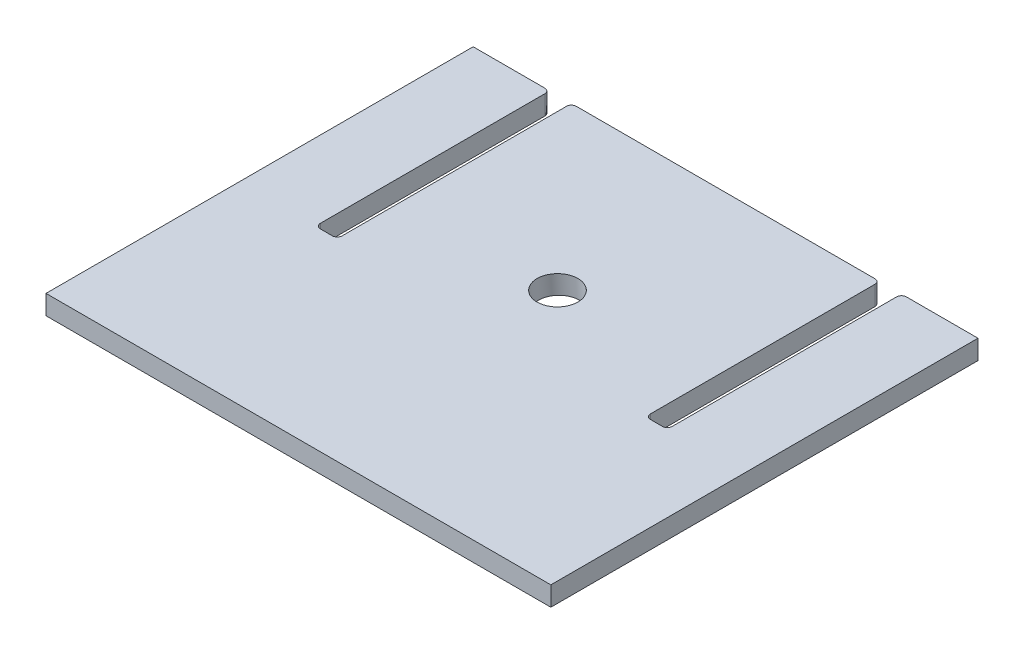
ISO-10303-21;
HEADER;
FILE_DESCRIPTION(('STEP AP214'),'2;1');
FILE_NAME('part.step','',(''),(''),'','','');
FILE_SCHEMA(('AUTOMOTIVE_DESIGN { 1 0 10303 214 1 1 1 1 }'));
ENDSEC;
DATA;
#1=APPLICATION_CONTEXT('core data for automotive mechanical design processes');
#2=APPLICATION_PROTOCOL_DEFINITION('international standard','automotive_design',2000,#1);
#3=PRODUCT_CONTEXT('',#1,'mechanical');
#4=PRODUCT('Part','Part','',(#3));
#5=PRODUCT_RELATED_PRODUCT_CATEGORY('part','',(#4));
#6=PRODUCT_DEFINITION_FORMATION('','',#4);
#7=PRODUCT_DEFINITION_CONTEXT('part definition',#1,'design');
#8=PRODUCT_DEFINITION('design','',#6,#7);
#9=PRODUCT_DEFINITION_SHAPE('','',#8);
#10=(LENGTH_UNIT() NAMED_UNIT(*) SI_UNIT(.MILLI.,.METRE.));
#11=(NAMED_UNIT(*) PLANE_ANGLE_UNIT() SI_UNIT($,.RADIAN.));
#12=(NAMED_UNIT(*) SI_UNIT($,.STERADIAN.) SOLID_ANGLE_UNIT());
#13=UNCERTAINTY_MEASURE_WITH_UNIT(LENGTH_MEASURE(1.E-05),#10,'distance_accuracy_value','');
#14=(GEOMETRIC_REPRESENTATION_CONTEXT(3) GLOBAL_UNCERTAINTY_ASSIGNED_CONTEXT((#13)) GLOBAL_UNIT_ASSIGNED_CONTEXT((#10,
#11,#12)) REPRESENTATION_CONTEXT('',''));
#15=CARTESIAN_POINT('',(0.,0.,0.));
#16=DIRECTION('',(0.,0.,1.));
#17=DIRECTION('',(1.,0.,0.));
#18=AXIS2_PLACEMENT_3D('',#15,#16,#17);
#19=CARTESIAN_POINT('',(-165.1,6.35,-139.7));
#20=DIRECTION('',(0.,0.,1.));
#21=DIRECTION('',(1.,0.,0.));
#22=AXIS2_PLACEMENT_3D('',#19,#20,#21);
#23=PLANE('',#22);
#24=DIRECTION('',(-1.,0.,0.));
#25=VECTOR('',#24,1.);
#26=CARTESIAN_POINT('',(-165.1,6.35,-139.7));
#27=LINE('',#26,#25);
#28=CARTESIAN_POINT('',(-118.237,6.35,-139.7));
#29=VERTEX_POINT('',#28);
#30=CARTESIAN_POINT('',(-165.1,6.35,-139.7));
#31=VERTEX_POINT('',#30);
#32=EDGE_CURVE('E227',#29,#31,#27,.T.);
#33=ORIENTED_EDGE('',*,*,#32,.F.);
#34=DIRECTION('',(0.,1.,0.));
#35=VECTOR('',#34,1.);
#36=CARTESIAN_POINT('',(-118.237,6.35,-139.7));
#37=LINE('',#36,#35);
#38=CARTESIAN_POINT('',(-118.237,-6.35,-139.7));
#39=VERTEX_POINT('',#38);
#40=EDGE_CURVE('E62',#29,#39,#37,.F.);
#41=ORIENTED_EDGE('',*,*,#40,.T.);
#42=DIRECTION('',(-1.,0.,0.));
#43=VECTOR('',#42,1.);
#44=CARTESIAN_POINT('',(-165.1,-6.35,-139.7));
#45=LINE('',#44,#43);
#46=CARTESIAN_POINT('',(-165.1,-6.35,-139.7));
#47=VERTEX_POINT('',#46);
#48=EDGE_CURVE('E416',#39,#47,#45,.T.);
#49=ORIENTED_EDGE('',*,*,#48,.T.);
#50=DIRECTION('',(0.,-1.,0.));
#51=VECTOR('',#50,1.);
#52=CARTESIAN_POINT('',(-165.1,6.35,-139.7));
#53=LINE('',#52,#51);
#54=EDGE_CURVE('E197',#31,#47,#53,.T.);
#55=ORIENTED_EDGE('',*,*,#54,.F.);
#56=EDGE_LOOP('',(#33,#41,#49,#55));
#57=FACE_BOUND('',#56,.T.);
#58=ADVANCED_FACE('F46',(#57),#23,.F.);
#59=CARTESIAN_POINT('',(165.1,-6.35,-139.7));
#60=VERTEX_POINT('',#59);
#61=CARTESIAN_POINT('',(118.237,-6.35,-139.7));
#62=VERTEX_POINT('',#61);
#63=EDGE_CURVE('E211',#60,#62,#45,.T.);
#64=ORIENTED_EDGE('',*,*,#63,.T.);
#65=DIRECTION('',(0.,1.,0.));
#66=VECTOR('',#65,1.);
#67=CARTESIAN_POINT('',(118.237,6.35,-139.7));
#68=LINE('',#67,#66);
#69=CARTESIAN_POINT('',(118.237,6.35,-139.7));
#70=VERTEX_POINT('',#69);
#71=EDGE_CURVE('E327',#62,#70,#68,.T.);
#72=ORIENTED_EDGE('',*,*,#71,.T.);
#73=CARTESIAN_POINT('',(165.1,6.35,-139.7));
#74=VERTEX_POINT('',#73);
#75=EDGE_CURVE('E228',#74,#70,#27,.T.);
#76=ORIENTED_EDGE('',*,*,#75,.F.);
#77=DIRECTION('',(0.,-1.,0.));
#78=VECTOR('',#77,1.);
#79=CARTESIAN_POINT('',(165.1,6.35,-139.7));
#80=LINE('',#79,#78);
#81=EDGE_CURVE('E214',#74,#60,#80,.T.);
#82=ORIENTED_EDGE('',*,*,#81,.T.);
#83=EDGE_LOOP('',(#64,#72,#76,#82));
#84=FACE_BOUND('',#83,.T.);
#85=ADVANCED_FACE('F461',(#84),#23,.F.);
#86=CARTESIAN_POINT('',(165.1,6.35,139.7));
#87=DIRECTION('',(-1.,0.,0.));
#88=DIRECTION('',(0.,0.,1.));
#89=AXIS2_PLACEMENT_3D('',#86,#87,#88);
#90=PLANE('',#89);
#91=DIRECTION('',(0.,0.,-1.));
#92=VECTOR('',#91,1.);
#93=CARTESIAN_POINT('',(165.1,-6.35,139.7));
#94=LINE('',#93,#92);
#95=CARTESIAN_POINT('',(165.1,-6.35,139.7));
#96=VERTEX_POINT('',#95);
#97=EDGE_CURVE('E203',#96,#60,#94,.T.);
#98=ORIENTED_EDGE('',*,*,#97,.T.);
#99=ORIENTED_EDGE('',*,*,#81,.F.);
#100=DIRECTION('',(0.,0.,-1.));
#101=VECTOR('',#100,1.);
#102=CARTESIAN_POINT('',(165.1,6.35,139.7));
#103=LINE('',#102,#101);
#104=CARTESIAN_POINT('',(165.1,6.35,139.7));
#105=VERTEX_POINT('',#104);
#106=EDGE_CURVE('E205',#105,#74,#103,.T.);
#107=ORIENTED_EDGE('',*,*,#106,.F.);
#108=DIRECTION('',(0.,-1.,0.));
#109=VECTOR('',#108,1.);
#110=CARTESIAN_POINT('',(165.1,6.35,139.7));
#111=LINE('',#110,#109);
#112=EDGE_CURVE('E190',#105,#96,#111,.T.);
#113=ORIENTED_EDGE('',*,*,#112,.T.);
#114=EDGE_LOOP('',(#98,#99,#107,#113));
#115=FACE_BOUND('',#114,.T.);
#116=ADVANCED_FACE('F201',(#115),#90,.F.);
#117=CARTESIAN_POINT('',(97.663,6.35,-139.7));
#118=VERTEX_POINT('',#117);
#119=CARTESIAN_POINT('',(-97.663,6.35,-139.7));
#120=VERTEX_POINT('',#119);
#121=EDGE_CURVE('E232',#118,#120,#27,.T.);
#122=ORIENTED_EDGE('',*,*,#121,.F.);
#123=DIRECTION('',(0.,1.,0.));
#124=VECTOR('',#123,1.);
#125=CARTESIAN_POINT('',(97.663,6.35,-139.7));
#126=LINE('',#125,#124);
#127=CARTESIAN_POINT('',(97.663,-6.35,-139.7));
#128=VERTEX_POINT('',#127);
#129=EDGE_CURVE('E313',#118,#128,#126,.F.);
#130=ORIENTED_EDGE('',*,*,#129,.T.);
#131=CARTESIAN_POINT('',(-97.663,-6.35,-139.7));
#132=VERTEX_POINT('',#131);
#133=EDGE_CURVE('E207',#128,#132,#45,.T.);
#134=ORIENTED_EDGE('',*,*,#133,.T.);
#135=DIRECTION('',(0.,1.,0.));
#136=VECTOR('',#135,1.);
#137=CARTESIAN_POINT('',(-97.663,6.35,-139.7));
#138=LINE('',#137,#136);
#139=EDGE_CURVE('E309',#132,#120,#138,.T.);
#140=ORIENTED_EDGE('',*,*,#139,.T.);
#141=EDGE_LOOP('',(#122,#130,#134,#140));
#142=FACE_BOUND('',#141,.T.);
#143=ADVANCED_FACE('F411',(#142),#23,.F.);
#144=CARTESIAN_POINT('',(-165.1,6.35,139.7));
#145=DIRECTION('',(1.,0.,0.));
#146=DIRECTION('',(0.,0.,-1.));
#147=AXIS2_PLACEMENT_3D('',#144,#145,#146);
#148=PLANE('',#147);
#149=DIRECTION('',(0.,0.,1.));
#150=VECTOR('',#149,1.);
#151=CARTESIAN_POINT('',(-165.1,-6.35,139.7));
#152=LINE('',#151,#150);
#153=CARTESIAN_POINT('',(-165.1,-6.35,139.7));
#154=VERTEX_POINT('',#153);
#155=EDGE_CURVE('E415',#47,#154,#152,.T.);
#156=ORIENTED_EDGE('',*,*,#155,.T.);
#157=DIRECTION('',(0.,-1.,0.));
#158=VECTOR('',#157,1.);
#159=CARTESIAN_POINT('',(-165.1,6.35,139.7));
#160=LINE('',#159,#158);
#161=CARTESIAN_POINT('',(-165.1,6.35,139.7));
#162=VERTEX_POINT('',#161);
#163=EDGE_CURVE('E193',#162,#154,#160,.T.);
#164=ORIENTED_EDGE('',*,*,#163,.F.);
#165=DIRECTION('',(0.,0.,1.));
#166=VECTOR('',#165,1.);
#167=CARTESIAN_POINT('',(-165.1,6.35,139.7));
#168=LINE('',#167,#166);
#169=EDGE_CURVE('E224',#31,#162,#168,.T.);
#170=ORIENTED_EDGE('',*,*,#169,.F.);
#171=ORIENTED_EDGE('',*,*,#54,.T.);
#172=EDGE_LOOP('',(#156,#164,#170,#171));
#173=FACE_BOUND('',#172,.T.);
#174=ADVANCED_FACE('F425',(#173),#148,.F.);
#175=CARTESIAN_POINT('',(-165.1,6.35,139.7));
#176=DIRECTION('',(0.,0.,-1.));
#177=DIRECTION('',(-1.,0.,0.));
#178=AXIS2_PLACEMENT_3D('',#175,#176,#177);
#179=PLANE('',#178);
#180=DIRECTION('',(1.,0.,0.));
#181=VECTOR('',#180,1.);
#182=CARTESIAN_POINT('',(-165.1,-6.35,139.7));
#183=LINE('',#182,#181);
#184=EDGE_CURVE('E186',#154,#96,#183,.T.);
#185=ORIENTED_EDGE('',*,*,#184,.T.);
#186=ORIENTED_EDGE('',*,*,#112,.F.);
#187=DIRECTION('',(1.,0.,0.));
#188=VECTOR('',#187,1.);
#189=CARTESIAN_POINT('',(-165.1,6.35,139.7));
#190=LINE('',#189,#188);
#191=EDGE_CURVE('E221',#162,#105,#190,.T.);
#192=ORIENTED_EDGE('',*,*,#191,.F.);
#193=ORIENTED_EDGE('',*,*,#163,.T.);
#194=EDGE_LOOP('',(#185,#186,#192,#193));
#195=FACE_BOUND('',#194,.T.);
#196=ADVANCED_FACE('F188',(#195),#179,.F.);
#197=CARTESIAN_POINT('',(0.,6.35,0.));
#198=DIRECTION('',(0.,-1.,0.));
#199=DIRECTION('',(0.,0.,-1.));
#200=AXIS2_PLACEMENT_3D('',#197,#198,#199);
#201=PLANE('',#200);
#202=CARTESIAN_POINT('',(0.420618124772805,6.34999999999999,-29.3287996232021));
#203=DIRECTION('',(0.,-1.,0.));
#204=DIRECTION('',(-0.0668404015347865,0.,0.99776367979731));
#205=AXIS2_PLACEMENT_3D('',#202,#203,#204);
#206=ELLIPSE('',#205,13.3666033976119,13.3350000000001);
#207=CARTESIAN_POINT('',(-0.472811013479819,6.34999999999999,-15.9920882308096));
#208=VERTEX_POINT('',#207);
#209=EDGE_CURVE('E239',#208,#208,#206,.F.);
#210=ORIENTED_EDGE('',*,*,#209,.F.);
#211=EDGE_LOOP('',(#210));
#212=FACE_BOUND('',#211,.T.);
#213=DIRECTION('',(0.,0.,1.));
#214=VECTOR('',#213,1.);
#215=CARTESIAN_POINT('',(100.838,6.35,-139.7));
#216=LINE('',#215,#214);
#217=CARTESIAN_POINT('',(100.838,6.35,-136.525));
#218=VERTEX_POINT('',#217);
#219=CARTESIAN_POINT('',(100.838,6.35,10.287));
#220=VERTEX_POINT('',#219);
#221=EDGE_CURVE('E245',#218,#220,#216,.T.);
#222=ORIENTED_EDGE('',*,*,#221,.F.);
#223=CARTESIAN_POINT('',(97.663,6.35,-136.525));
#224=DIRECTION('',(0.,-1.,0.));
#225=DIRECTION('',(0.,0.,-1.));
#226=AXIS2_PLACEMENT_3D('',#223,#224,#225);
#227=CIRCLE('',#226,3.175);
#228=EDGE_CURVE('E306',#218,#118,#227,.F.);
#229=ORIENTED_EDGE('',*,*,#228,.T.);
#230=ORIENTED_EDGE('',*,*,#121,.T.);
#231=CARTESIAN_POINT('',(-97.663,6.35,-136.525));
#232=DIRECTION('',(0.,-1.,0.));
#233=DIRECTION('',(0.,0.,-1.));
#234=AXIS2_PLACEMENT_3D('',#231,#232,#233);
#235=CIRCLE('',#234,3.175);
#236=CARTESIAN_POINT('',(-100.838,6.35,-136.525));
#237=VERTEX_POINT('',#236);
#238=EDGE_CURVE('E297',#120,#237,#235,.F.);
#239=ORIENTED_EDGE('',*,*,#238,.T.);
#240=DIRECTION('',(0.,0.,-1.));
#241=VECTOR('',#240,1.);
#242=CARTESIAN_POINT('',(-100.838,6.35,-139.7));
#243=LINE('',#242,#241);
#244=CARTESIAN_POINT('',(-100.838,6.35,10.287));
#245=VERTEX_POINT('',#244);
#246=EDGE_CURVE('E240',#245,#237,#243,.T.);
#247=ORIENTED_EDGE('',*,*,#246,.F.);
#248=CARTESIAN_POINT('',(-104.013,6.35,10.287));
#249=DIRECTION('',(0.,-1.,0.));
#250=DIRECTION('',(0.,0.,-1.));
#251=AXIS2_PLACEMENT_3D('',#248,#249,#250);
#252=CIRCLE('',#251,3.175);
#253=CARTESIAN_POINT('',(-104.013,6.35,13.462));
#254=VERTEX_POINT('',#253);
#255=EDGE_CURVE('E55',#245,#254,#252,.T.);
#256=ORIENTED_EDGE('',*,*,#255,.T.);
#257=DIRECTION('',(1.,0.,0.));
#258=VECTOR('',#257,1.);
#259=CARTESIAN_POINT('',(-114.3,6.35,13.462));
#260=LINE('',#259,#258);
#261=CARTESIAN_POINT('',(-111.887,6.35,13.462));
#262=VERTEX_POINT('',#261);
#263=EDGE_CURVE('E235',#262,#254,#260,.T.);
#264=ORIENTED_EDGE('',*,*,#263,.F.);
#265=CARTESIAN_POINT('',(-111.887,6.35,10.287));
#266=DIRECTION('',(0.,-1.,0.));
#267=DIRECTION('',(0.,0.,-1.));
#268=AXIS2_PLACEMENT_3D('',#265,#266,#267);
#269=CIRCLE('',#268,3.175);
#270=CARTESIAN_POINT('',(-115.062,6.35,10.287));
#271=VERTEX_POINT('',#270);
#272=EDGE_CURVE('E380',#262,#271,#269,.T.);
#273=ORIENTED_EDGE('',*,*,#272,.T.);
#274=DIRECTION('',(0.,0.,1.));
#275=VECTOR('',#274,1.);
#276=CARTESIAN_POINT('',(-115.062,6.35,-139.7));
#277=LINE('',#276,#275);
#278=CARTESIAN_POINT('',(-115.062,6.35,-136.525));
#279=VERTEX_POINT('',#278);
#280=EDGE_CURVE('E241',#279,#271,#277,.T.);
#281=ORIENTED_EDGE('',*,*,#280,.F.);
#282=CARTESIAN_POINT('',(-118.237,6.35,-136.525));
#283=DIRECTION('',(0.,-1.,0.));
#284=DIRECTION('',(0.,0.,-1.));
#285=AXIS2_PLACEMENT_3D('',#282,#283,#284);
#286=CIRCLE('',#285,3.175);
#287=EDGE_CURVE('E300',#279,#29,#286,.F.);
#288=ORIENTED_EDGE('',*,*,#287,.T.);
#289=ORIENTED_EDGE('',*,*,#32,.T.);
#290=ORIENTED_EDGE('',*,*,#169,.T.);
#291=ORIENTED_EDGE('',*,*,#191,.T.);
#292=ORIENTED_EDGE('',*,*,#106,.T.);
#293=ORIENTED_EDGE('',*,*,#75,.T.);
#294=CARTESIAN_POINT('',(118.237,6.35,-136.525));
#295=DIRECTION('',(0.,-1.,0.));
#296=DIRECTION('',(0.,0.,-1.));
#297=AXIS2_PLACEMENT_3D('',#294,#295,#296);
#298=CIRCLE('',#297,3.175);
#299=CARTESIAN_POINT('',(115.062,6.35,-136.525));
#300=VERTEX_POINT('',#299);
#301=EDGE_CURVE('E303',#70,#300,#298,.F.);
#302=ORIENTED_EDGE('',*,*,#301,.T.);
#303=DIRECTION('',(0.,0.,-1.));
#304=VECTOR('',#303,1.);
#305=CARTESIAN_POINT('',(115.062,6.35,-139.7));
#306=LINE('',#305,#304);
#307=CARTESIAN_POINT('',(115.062,6.35,10.287));
#308=VERTEX_POINT('',#307);
#309=EDGE_CURVE('E267',#308,#300,#306,.T.);
#310=ORIENTED_EDGE('',*,*,#309,.F.);
#311=CARTESIAN_POINT('',(111.887,6.35,10.287));
#312=DIRECTION('',(0.,-1.,0.));
#313=DIRECTION('',(0.,0.,-1.));
#314=AXIS2_PLACEMENT_3D('',#311,#312,#313);
#315=CIRCLE('',#314,3.175);
#316=CARTESIAN_POINT('',(111.887,6.35,13.462));
#317=VERTEX_POINT('',#316);
#318=EDGE_CURVE('E368',#308,#317,#315,.T.);
#319=ORIENTED_EDGE('',*,*,#318,.T.);
#320=DIRECTION('',(1.,0.,0.));
#321=VECTOR('',#320,1.);
#322=CARTESIAN_POINT('',(114.3,6.35,13.462));
#323=LINE('',#322,#321);
#324=CARTESIAN_POINT('',(104.013,6.35,13.462));
#325=VERTEX_POINT('',#324);
#326=EDGE_CURVE('E263',#325,#317,#323,.T.);
#327=ORIENTED_EDGE('',*,*,#326,.F.);
#328=CARTESIAN_POINT('',(104.013,6.35,10.287));
#329=DIRECTION('',(0.,-1.,0.));
#330=DIRECTION('',(0.,0.,-1.));
#331=AXIS2_PLACEMENT_3D('',#328,#329,#330);
#332=CIRCLE('',#331,3.175);
#333=EDGE_CURVE('E374',#325,#220,#332,.T.);
#334=ORIENTED_EDGE('',*,*,#333,.T.);
#335=EDGE_LOOP('',(#222,#229,#230,#239,#247,#256,#264,#273,#281,#288,#289,#290,#291,#292,#293,
#302,#310,#319,#327,#334));
#336=FACE_BOUND('',#335,.T.);
#337=ADVANCED_FACE('F390',(#212,#336),#201,.F.);
#338=CARTESIAN_POINT('',(0.,-6.35,0.));
#339=DIRECTION('',(0.,-1.,0.));
#340=DIRECTION('',(0.,0.,-1.));
#341=AXIS2_PLACEMENT_3D('',#338,#339,#340);
#342=PLANE('',#341);
#343=CARTESIAN_POINT('',(0.47909515506259,-6.34999999999999,-30.2017186300574));
#344=DIRECTION('',(0.,-1.,0.));
#345=DIRECTION('',(-0.0668404015347865,0.,0.99776367979731));
#346=AXIS2_PLACEMENT_3D('',#343,#344,#345);
#347=ELLIPSE('',#346,13.3666033976119,13.3350000000001);
#348=CARTESIAN_POINT('',(-0.414333983190034,-6.34999999999999,-16.8650072376649));
#349=VERTEX_POINT('',#348);
#350=EDGE_CURVE('E251',#349,#349,#347,.F.);
#351=ORIENTED_EDGE('',*,*,#350,.T.);
#352=EDGE_LOOP('',(#351));
#353=FACE_BOUND('',#352,.T.);
#354=ORIENTED_EDGE('',*,*,#133,.F.);
#355=CARTESIAN_POINT('',(97.663,-6.35,-136.525));
#356=DIRECTION('',(0.,-1.,0.));
#357=DIRECTION('',(0.,0.,-1.));
#358=AXIS2_PLACEMENT_3D('',#355,#356,#357);
#359=CIRCLE('',#358,3.175);
#360=CARTESIAN_POINT('',(100.838,-6.35,-136.525));
#361=VERTEX_POINT('',#360);
#362=EDGE_CURVE('E324',#128,#361,#359,.T.);
#363=ORIENTED_EDGE('',*,*,#362,.T.);
#364=DIRECTION('',(0.,0.,1.));
#365=VECTOR('',#364,1.);
#366=CARTESIAN_POINT('',(100.838,-6.35,-139.7));
#367=LINE('',#366,#365);
#368=CARTESIAN_POINT('',(100.838,-6.35,10.287));
#369=VERTEX_POINT('',#368);
#370=EDGE_CURVE('E259',#361,#369,#367,.T.);
#371=ORIENTED_EDGE('',*,*,#370,.T.);
#372=CARTESIAN_POINT('',(104.013,-6.35,10.287));
#373=DIRECTION('',(0.,-1.,0.));
#374=DIRECTION('',(0.,0.,-1.));
#375=AXIS2_PLACEMENT_3D('',#372,#373,#374);
#376=CIRCLE('',#375,3.175);
#377=CARTESIAN_POINT('',(104.013,-6.35,13.462));
#378=VERTEX_POINT('',#377);
#379=EDGE_CURVE('E377',#369,#378,#376,.F.);
#380=ORIENTED_EDGE('',*,*,#379,.T.);
#381=DIRECTION('',(1.,0.,0.));
#382=VECTOR('',#381,1.);
#383=CARTESIAN_POINT('',(114.3,-6.35,13.462));
#384=LINE('',#383,#382);
#385=CARTESIAN_POINT('',(111.887,-6.35,13.462));
#386=VERTEX_POINT('',#385);
#387=EDGE_CURVE('E274',#378,#386,#384,.T.);
#388=ORIENTED_EDGE('',*,*,#387,.T.);
#389=CARTESIAN_POINT('',(111.887,-6.35,10.287));
#390=DIRECTION('',(0.,-1.,0.));
#391=DIRECTION('',(0.,0.,-1.));
#392=AXIS2_PLACEMENT_3D('',#389,#390,#391);
#393=CIRCLE('',#392,3.175);
#394=CARTESIAN_POINT('',(115.062,-6.35,10.287));
#395=VERTEX_POINT('',#394);
#396=EDGE_CURVE('E371',#386,#395,#393,.F.);
#397=ORIENTED_EDGE('',*,*,#396,.T.);
#398=DIRECTION('',(0.,0.,-1.));
#399=VECTOR('',#398,1.);
#400=CARTESIAN_POINT('',(115.062,-6.35,-139.7));
#401=LINE('',#400,#399);
#402=CARTESIAN_POINT('',(115.062,-6.35,-136.525));
#403=VERTEX_POINT('',#402);
#404=EDGE_CURVE('E278',#395,#403,#401,.T.);
#405=ORIENTED_EDGE('',*,*,#404,.T.);
#406=CARTESIAN_POINT('',(118.237,-6.35,-136.525));
#407=DIRECTION('',(0.,-1.,0.));
#408=DIRECTION('',(0.,0.,-1.));
#409=AXIS2_PLACEMENT_3D('',#406,#407,#408);
#410=CIRCLE('',#409,3.175);
#411=EDGE_CURVE('E70',#403,#62,#410,.T.);
#412=ORIENTED_EDGE('',*,*,#411,.T.);
#413=ORIENTED_EDGE('',*,*,#63,.F.);
#414=ORIENTED_EDGE('',*,*,#97,.F.);
#415=ORIENTED_EDGE('',*,*,#184,.F.);
#416=ORIENTED_EDGE('',*,*,#155,.F.);
#417=ORIENTED_EDGE('',*,*,#48,.F.);
#418=CARTESIAN_POINT('',(-118.237,-6.35,-136.525));
#419=DIRECTION('',(0.,-1.,0.));
#420=DIRECTION('',(0.,0.,-1.));
#421=AXIS2_PLACEMENT_3D('',#418,#419,#420);
#422=CIRCLE('',#421,3.175);
#423=CARTESIAN_POINT('',(-115.062,-6.35,-136.525));
#424=VERTEX_POINT('',#423);
#425=EDGE_CURVE('E319',#39,#424,#422,.T.);
#426=ORIENTED_EDGE('',*,*,#425,.T.);
#427=DIRECTION('',(0.,0.,1.));
#428=VECTOR('',#427,1.);
#429=CARTESIAN_POINT('',(-115.062,-6.35,-139.7));
#430=LINE('',#429,#428);
#431=CARTESIAN_POINT('',(-115.062,-6.35,10.287));
#432=VERTEX_POINT('',#431);
#433=EDGE_CURVE('E246',#424,#432,#430,.T.);
#434=ORIENTED_EDGE('',*,*,#433,.T.);
#435=CARTESIAN_POINT('',(-111.887,-6.35,10.287));
#436=DIRECTION('',(0.,-1.,0.));
#437=DIRECTION('',(0.,0.,-1.));
#438=AXIS2_PLACEMENT_3D('',#435,#436,#437);
#439=CIRCLE('',#438,3.175);
#440=CARTESIAN_POINT('',(-111.887,-6.35,13.462));
#441=VERTEX_POINT('',#440);
#442=EDGE_CURVE('E383',#432,#441,#439,.F.);
#443=ORIENTED_EDGE('',*,*,#442,.T.);
#444=DIRECTION('',(1.,0.,0.));
#445=VECTOR('',#444,1.);
#446=CARTESIAN_POINT('',(-114.3,-6.35,13.462));
#447=LINE('',#446,#445);
#448=CARTESIAN_POINT('',(-104.013,-6.35,13.462));
#449=VERTEX_POINT('',#448);
#450=EDGE_CURVE('E250',#441,#449,#447,.T.);
#451=ORIENTED_EDGE('',*,*,#450,.T.);
#452=CARTESIAN_POINT('',(-104.013,-6.35,10.287));
#453=DIRECTION('',(0.,-1.,0.));
#454=DIRECTION('',(0.,0.,-1.));
#455=AXIS2_PLACEMENT_3D('',#452,#453,#454);
#456=CIRCLE('',#455,3.175);
#457=CARTESIAN_POINT('',(-100.838,-6.35,10.287));
#458=VERTEX_POINT('',#457);
#459=EDGE_CURVE('E12',#449,#458,#456,.F.);
#460=ORIENTED_EDGE('',*,*,#459,.T.);
#461=DIRECTION('',(0.,0.,-1.));
#462=VECTOR('',#461,1.);
#463=CARTESIAN_POINT('',(-100.838,-6.35,-139.7));
#464=LINE('',#463,#462);
#465=CARTESIAN_POINT('',(-100.838,-6.35,-136.525));
#466=VERTEX_POINT('',#465);
#467=EDGE_CURVE('E255',#458,#466,#464,.T.);
#468=ORIENTED_EDGE('',*,*,#467,.T.);
#469=CARTESIAN_POINT('',(-97.663,-6.35,-136.525));
#470=DIRECTION('',(0.,-1.,0.));
#471=DIRECTION('',(0.,0.,-1.));
#472=AXIS2_PLACEMENT_3D('',#469,#470,#471);
#473=CIRCLE('',#472,3.175);
#474=EDGE_CURVE('E316',#466,#132,#473,.T.);
#475=ORIENTED_EDGE('',*,*,#474,.T.);
#476=EDGE_LOOP('',(#354,#363,#371,#380,#388,#397,#405,#412,#413,#414,#415,#416,#417,#426,#434,
#443,#451,#460,#468,#475));
#477=FACE_BOUND('',#476,.T.);
#478=ADVANCED_FACE('F210',(#353,#477),#342,.T.);
#479=CARTESIAN_POINT('',(115.062,-6.35,-139.7));
#480=DIRECTION('',(1.,0.,0.));
#481=DIRECTION('',(0.,0.,-1.));
#482=AXIS2_PLACEMENT_3D('',#479,#480,#481);
#483=PLANE('',#482);
#484=ORIENTED_EDGE('',*,*,#309,.T.);
#485=DIRECTION('',(0.,1.,0.));
#486=VECTOR('',#485,1.);
#487=CARTESIAN_POINT('',(115.062,-6.35,-136.525));
#488=LINE('',#487,#486);
#489=EDGE_CURVE('E335',#300,#403,#488,.F.);
#490=ORIENTED_EDGE('',*,*,#489,.T.);
#491=ORIENTED_EDGE('',*,*,#404,.F.);
#492=DIRECTION('',(0.,1.,0.));
#493=VECTOR('',#492,1.);
#494=CARTESIAN_POINT('',(115.062,6.35,10.287));
#495=LINE('',#494,#493);
#496=EDGE_CURVE('E331',#395,#308,#495,.T.);
#497=ORIENTED_EDGE('',*,*,#496,.T.);
#498=EDGE_LOOP('',(#484,#490,#491,#497));
#499=FACE_BOUND('',#498,.T.);
#500=ADVANCED_FACE('F454',(#499),#483,.F.);
#501=CARTESIAN_POINT('',(114.3,-6.35,13.462));
#502=DIRECTION('',(0.,0.,1.));
#503=DIRECTION('',(1.,0.,0.));
#504=AXIS2_PLACEMENT_3D('',#501,#502,#503);
#505=PLANE('',#504);
#506=ORIENTED_EDGE('',*,*,#326,.T.);
#507=DIRECTION('',(0.,1.,0.));
#508=VECTOR('',#507,1.);
#509=CARTESIAN_POINT('',(111.887,-6.35,13.462));
#510=LINE('',#509,#508);
#511=EDGE_CURVE('E358',#317,#386,#510,.F.);
#512=ORIENTED_EDGE('',*,*,#511,.T.);
#513=ORIENTED_EDGE('',*,*,#387,.F.);
#514=DIRECTION('',(0.,1.,0.));
#515=VECTOR('',#514,1.);
#516=CARTESIAN_POINT('',(104.013,6.35,13.462));
#517=LINE('',#516,#515);
#518=EDGE_CURVE('E354',#378,#325,#517,.T.);
#519=ORIENTED_EDGE('',*,*,#518,.T.);
#520=EDGE_LOOP('',(#506,#512,#513,#519));
#521=FACE_BOUND('',#520,.T.);
#522=ADVANCED_FACE('F446',(#521),#505,.F.);
#523=CARTESIAN_POINT('',(100.838,-6.35,-139.7));
#524=DIRECTION('',(-1.,0.,0.));
#525=DIRECTION('',(0.,0.,1.));
#526=AXIS2_PLACEMENT_3D('',#523,#524,#525);
#527=PLANE('',#526);
#528=ORIENTED_EDGE('',*,*,#370,.F.);
#529=DIRECTION('',(0.,1.,0.));
#530=VECTOR('',#529,1.);
#531=CARTESIAN_POINT('',(100.838,-6.35,-136.525));
#532=LINE('',#531,#530);
#533=EDGE_CURVE('E293',#361,#218,#532,.T.);
#534=ORIENTED_EDGE('',*,*,#533,.T.);
#535=ORIENTED_EDGE('',*,*,#221,.T.);
#536=DIRECTION('',(0.,1.,0.));
#537=VECTOR('',#536,1.);
#538=CARTESIAN_POINT('',(100.838,-6.35,10.287));
#539=LINE('',#538,#537);
#540=EDGE_CURVE('E290',#220,#369,#539,.F.);
#541=ORIENTED_EDGE('',*,*,#540,.T.);
#542=EDGE_LOOP('',(#528,#534,#535,#541));
#543=FACE_BOUND('',#542,.T.);
#544=ADVANCED_FACE('F438',(#543),#527,.F.);
#545=CARTESIAN_POINT('',(-115.062,-6.35,-139.7));
#546=DIRECTION('',(-1.,0.,0.));
#547=DIRECTION('',(0.,0.,1.));
#548=AXIS2_PLACEMENT_3D('',#545,#546,#547);
#549=PLANE('',#548);
#550=ORIENTED_EDGE('',*,*,#433,.F.);
#551=DIRECTION('',(0.,1.,0.));
#552=VECTOR('',#551,1.);
#553=CARTESIAN_POINT('',(-115.062,-6.35,-136.525));
#554=LINE('',#553,#552);
#555=EDGE_CURVE('E341',#424,#279,#554,.T.);
#556=ORIENTED_EDGE('',*,*,#555,.T.);
#557=ORIENTED_EDGE('',*,*,#280,.T.);
#558=DIRECTION('',(0.,1.,0.));
#559=VECTOR('',#558,1.);
#560=CARTESIAN_POINT('',(-115.062,-6.35,10.287));
#561=LINE('',#560,#559);
#562=EDGE_CURVE('E338',#271,#432,#561,.F.);
#563=ORIENTED_EDGE('',*,*,#562,.T.);
#564=EDGE_LOOP('',(#550,#556,#557,#563));
#565=FACE_BOUND('',#564,.T.);
#566=ADVANCED_FACE('F492',(#565),#549,.F.);
#567=CARTESIAN_POINT('',(-100.838,-6.35,-139.7));
#568=DIRECTION('',(1.,0.,0.));
#569=DIRECTION('',(0.,0.,-1.));
#570=AXIS2_PLACEMENT_3D('',#567,#568,#569);
#571=PLANE('',#570);
#572=ORIENTED_EDGE('',*,*,#246,.T.);
#573=DIRECTION('',(0.,1.,0.));
#574=VECTOR('',#573,1.);
#575=CARTESIAN_POINT('',(-100.838,-6.35,-136.525));
#576=LINE('',#575,#574);
#577=EDGE_CURVE('E351',#237,#466,#576,.F.);
#578=ORIENTED_EDGE('',*,*,#577,.T.);
#579=ORIENTED_EDGE('',*,*,#467,.F.);
#580=DIRECTION('',(0.,1.,0.));
#581=VECTOR('',#580,1.);
#582=CARTESIAN_POINT('',(-100.838,6.35,10.287));
#583=LINE('',#582,#581);
#584=EDGE_CURVE('E347',#458,#245,#583,.T.);
#585=ORIENTED_EDGE('',*,*,#584,.T.);
#586=EDGE_LOOP('',(#572,#578,#579,#585));
#587=FACE_BOUND('',#586,.T.);
#588=ADVANCED_FACE('F402',(#587),#571,.F.);
#589=CARTESIAN_POINT('',(-114.3,-6.35,13.462));
#590=DIRECTION('',(0.,0.,1.));
#591=DIRECTION('',(1.,0.,0.));
#592=AXIS2_PLACEMENT_3D('',#589,#590,#591);
#593=PLANE('',#592);
#594=ORIENTED_EDGE('',*,*,#450,.F.);
#595=DIRECTION('',(0.,1.,0.));
#596=VECTOR('',#595,1.);
#597=CARTESIAN_POINT('',(-111.887,6.35,13.462));
#598=LINE('',#597,#596);
#599=EDGE_CURVE('E364',#441,#262,#598,.T.);
#600=ORIENTED_EDGE('',*,*,#599,.T.);
#601=ORIENTED_EDGE('',*,*,#263,.T.);
#602=DIRECTION('',(0.,1.,0.));
#603=VECTOR('',#602,1.);
#604=CARTESIAN_POINT('',(-104.013,-6.35,13.462));
#605=LINE('',#604,#603);
#606=EDGE_CURVE('E361',#254,#449,#605,.F.);
#607=ORIENTED_EDGE('',*,*,#606,.T.);
#608=EDGE_LOOP('',(#594,#600,#601,#607));
#609=FACE_BOUND('',#608,.T.);
#610=ADVANCED_FACE('F396',(#609),#593,.F.);
#611=CARTESIAN_POINT('',(0.803083946956162,-76.7136562366121,-35.038078702559));
#612=DIRECTION('',(-0.00459360392298645,0.9976356448477,0.0685712690003061));
#613=DIRECTION('',(0.,0.0685719924796838,-0.99764617066742));
#614=AXIS2_PLACEMENT_3D('',#611,#612,#613);
#615=CYLINDRICAL_SURFACE('',#614,13.3350000000001);
#616=ORIENTED_EDGE('',*,*,#350,.F.);
#617=EDGE_LOOP('',(#616));
#618=FACE_BOUND('',#617,.T.);
#619=ORIENTED_EDGE('',*,*,#209,.T.);
#620=EDGE_LOOP('',(#619));
#621=FACE_BOUND('',#620,.T.);
#622=ADVANCED_FACE('F487',(#618,#621),#615,.F.);
#623=CARTESIAN_POINT('',(97.663,-6.35,-136.525));
#624=DIRECTION('',(0.,1.,0.));
#625=DIRECTION('',(0.,0.,1.));
#626=AXIS2_PLACEMENT_3D('',#623,#624,#625);
#627=CYLINDRICAL_SURFACE('',#626,3.175);
#628=ORIENTED_EDGE('',*,*,#362,.F.);
#629=ORIENTED_EDGE('',*,*,#129,.F.);
#630=ORIENTED_EDGE('',*,*,#228,.F.);
#631=ORIENTED_EDGE('',*,*,#533,.F.);
#632=EDGE_LOOP('',(#628,#629,#630,#631));
#633=FACE_BOUND('',#632,.T.);
#634=ADVANCED_FACE('F433',(#633),#627,.T.);
#635=CARTESIAN_POINT('',(118.237,6.35,-136.525));
#636=DIRECTION('',(0.,1.,0.));
#637=DIRECTION('',(0.,0.,1.));
#638=AXIS2_PLACEMENT_3D('',#635,#636,#637);
#639=CYLINDRICAL_SURFACE('',#638,3.175);
#640=ORIENTED_EDGE('',*,*,#411,.F.);
#641=ORIENTED_EDGE('',*,*,#489,.F.);
#642=ORIENTED_EDGE('',*,*,#301,.F.);
#643=ORIENTED_EDGE('',*,*,#71,.F.);
#644=EDGE_LOOP('',(#640,#641,#642,#643));
#645=FACE_BOUND('',#644,.T.);
#646=ADVANCED_FACE('F458',(#645),#639,.T.);
#647=CARTESIAN_POINT('',(-118.237,-6.35,-136.525));
#648=DIRECTION('',(0.,1.,0.));
#649=DIRECTION('',(0.,0.,1.));
#650=AXIS2_PLACEMENT_3D('',#647,#648,#649);
#651=CYLINDRICAL_SURFACE('',#650,3.175);
#652=ORIENTED_EDGE('',*,*,#425,.F.);
#653=ORIENTED_EDGE('',*,*,#40,.F.);
#654=ORIENTED_EDGE('',*,*,#287,.F.);
#655=ORIENTED_EDGE('',*,*,#555,.F.);
#656=EDGE_LOOP('',(#652,#653,#654,#655));
#657=FACE_BOUND('',#656,.T.);
#658=ADVANCED_FACE('F507',(#657),#651,.T.);
#659=CARTESIAN_POINT('',(-97.663,6.35,-136.525));
#660=DIRECTION('',(0.,1.,0.));
#661=DIRECTION('',(0.,0.,1.));
#662=AXIS2_PLACEMENT_3D('',#659,#660,#661);
#663=CYLINDRICAL_SURFACE('',#662,3.175);
#664=ORIENTED_EDGE('',*,*,#474,.F.);
#665=ORIENTED_EDGE('',*,*,#577,.F.);
#666=ORIENTED_EDGE('',*,*,#238,.F.);
#667=ORIENTED_EDGE('',*,*,#139,.F.);
#668=EDGE_LOOP('',(#664,#665,#666,#667));
#669=FACE_BOUND('',#668,.T.);
#670=ADVANCED_FACE('F405',(#669),#663,.T.);
#671=CARTESIAN_POINT('',(111.887,-6.35,10.287));
#672=DIRECTION('',(0.,-1.,0.));
#673=DIRECTION('',(0.,0.,-1.));
#674=AXIS2_PLACEMENT_3D('',#671,#672,#673);
#675=CYLINDRICAL_SURFACE('',#674,3.175);
#676=ORIENTED_EDGE('',*,*,#396,.F.);
#677=ORIENTED_EDGE('',*,*,#511,.F.);
#678=ORIENTED_EDGE('',*,*,#318,.F.);
#679=ORIENTED_EDGE('',*,*,#496,.F.);
#680=EDGE_LOOP('',(#676,#677,#678,#679));
#681=FACE_BOUND('',#680,.T.);
#682=ADVANCED_FACE('F450',(#681),#675,.F.);
#683=CARTESIAN_POINT('',(104.013,-6.35,10.287));
#684=DIRECTION('',(0.,-1.,0.));
#685=DIRECTION('',(0.,0.,-1.));
#686=AXIS2_PLACEMENT_3D('',#683,#684,#685);
#687=CYLINDRICAL_SURFACE('',#686,3.175);
#688=ORIENTED_EDGE('',*,*,#379,.F.);
#689=ORIENTED_EDGE('',*,*,#540,.F.);
#690=ORIENTED_EDGE('',*,*,#333,.F.);
#691=ORIENTED_EDGE('',*,*,#518,.F.);
#692=EDGE_LOOP('',(#688,#689,#690,#691));
#693=FACE_BOUND('',#692,.T.);
#694=ADVANCED_FACE('F441',(#693),#687,.F.);
#695=CARTESIAN_POINT('',(-111.887,-6.35,10.287));
#696=DIRECTION('',(0.,-1.,0.));
#697=DIRECTION('',(0.,0.,-1.));
#698=AXIS2_PLACEMENT_3D('',#695,#696,#697);
#699=CYLINDRICAL_SURFACE('',#698,3.175);
#700=ORIENTED_EDGE('',*,*,#442,.F.);
#701=ORIENTED_EDGE('',*,*,#562,.F.);
#702=ORIENTED_EDGE('',*,*,#272,.F.);
#703=ORIENTED_EDGE('',*,*,#599,.F.);
#704=EDGE_LOOP('',(#700,#701,#702,#703));
#705=FACE_BOUND('',#704,.T.);
#706=ADVANCED_FACE('F516',(#705),#699,.F.);
#707=CARTESIAN_POINT('',(-104.013,-6.35,10.287));
#708=DIRECTION('',(0.,-1.,0.));
#709=DIRECTION('',(0.,0.,-1.));
#710=AXIS2_PLACEMENT_3D('',#707,#708,#709);
#711=CYLINDRICAL_SURFACE('',#710,3.175);
#712=ORIENTED_EDGE('',*,*,#459,.F.);
#713=ORIENTED_EDGE('',*,*,#606,.F.);
#714=ORIENTED_EDGE('',*,*,#255,.F.);
#715=ORIENTED_EDGE('',*,*,#584,.F.);
#716=EDGE_LOOP('',(#712,#713,#714,#715));
#717=FACE_BOUND('',#716,.T.);
#718=ADVANCED_FACE('F48',(#717),#711,.F.);
#719=CLOSED_SHELL('',(#58,#85,#116,#143,#174,#196,#337,#478,#500,#522,#544,#566,#588,#610,#622,
#634,#646,#658,#670,#682,#694,#706,#718));
#720=MANIFOLD_SOLID_BREP('B2',#719);
#721=ADVANCED_BREP_SHAPE_REPRESENTATION('',(#18,#720),#14);
#722=SHAPE_DEFINITION_REPRESENTATION(#9,#721);
ENDSEC;
END-ISO-10303-21;
